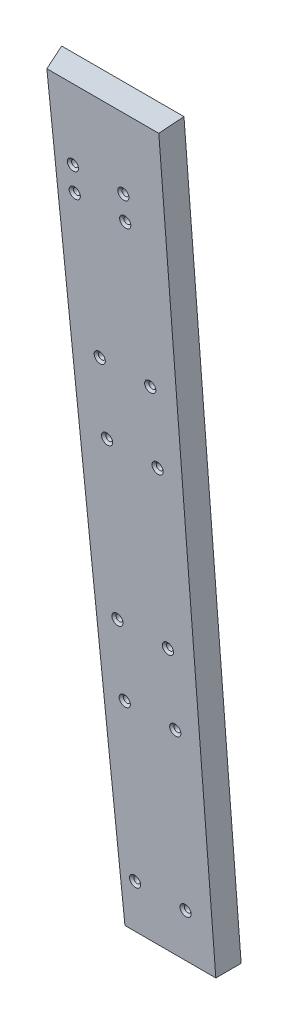
ISO-10303-21;
HEADER;
FILE_DESCRIPTION(('STEP AP214'),'2;1');
FILE_NAME('part.step','',(''),(''),'','','');
FILE_SCHEMA(('AUTOMOTIVE_DESIGN { 1 0 10303 214 1 1 1 1 }'));
ENDSEC;
DATA;
#1=APPLICATION_CONTEXT('core data for automotive mechanical design processes');
#2=APPLICATION_PROTOCOL_DEFINITION('international standard','automotive_design',2000,#1);
#3=PRODUCT_CONTEXT('',#1,'mechanical');
#4=PRODUCT('Part','Part','',(#3));
#5=PRODUCT_RELATED_PRODUCT_CATEGORY('part','',(#4));
#6=PRODUCT_DEFINITION_FORMATION('','',#4);
#7=PRODUCT_DEFINITION_CONTEXT('part definition',#1,'design');
#8=PRODUCT_DEFINITION('design','',#6,#7);
#9=PRODUCT_DEFINITION_SHAPE('','',#8);
#10=(LENGTH_UNIT() NAMED_UNIT(*) SI_UNIT(.MILLI.,.METRE.));
#11=(NAMED_UNIT(*) PLANE_ANGLE_UNIT() SI_UNIT($,.RADIAN.));
#12=(NAMED_UNIT(*) SI_UNIT($,.STERADIAN.) SOLID_ANGLE_UNIT());
#13=UNCERTAINTY_MEASURE_WITH_UNIT(LENGTH_MEASURE(1.E-05),#10,'distance_accuracy_value','');
#14=(GEOMETRIC_REPRESENTATION_CONTEXT(3) GLOBAL_UNCERTAINTY_ASSIGNED_CONTEXT((#13)) GLOBAL_UNIT_ASSIGNED_CONTEXT((#10,
#11,#12)) REPRESENTATION_CONTEXT('',''));
#15=CARTESIAN_POINT('',(0.,0.,0.));
#16=DIRECTION('',(0.,0.,1.));
#17=DIRECTION('',(1.,0.,0.));
#18=AXIS2_PLACEMENT_3D('',#15,#16,#17);
#19=CARTESIAN_POINT('',(-312.419999999991,5767.77608949546,3278.73923989057));
#20=DIRECTION('',(0.,-0.0748289111295099,0.997196386906397));
#21=DIRECTION('',(0.,-0.997196386906397,-0.0748289111295098));
#22=AXIS2_PLACEMENT_3D('',#19,#20,#21);
#23=PLANE('',#22);
#24=CARTESIAN_POINT('',(-343.4825,5710.44401659627,3274.43708171574));
#25=DIRECTION('',(0.,0.0748289111295102,-0.997196386906397));
#26=DIRECTION('',(0.,-0.997196386906397,-0.0748289111295098));
#27=AXIS2_PLACEMENT_3D('',#24,#25,#26);
#28=CIRCLE('',#27,4.21640000000001);
#29=CARTESIAN_POINT('',(-343.4825,5706.23943775052,3274.12157309485));
#30=VERTEX_POINT('',#29);
#31=EDGE_CURVE('E549',#30,#30,#28,.T.);
#32=ORIENTED_EDGE('',*,*,#31,.T.);
#33=EDGE_LOOP('',(#32));
#34=FACE_BOUND('',#33,.T.);
#35=CARTESIAN_POINT('',(-381.582499999999,5710.44401659627,3274.43708171574));
#36=DIRECTION('',(0.,0.0748289111295102,-0.997196386906397));
#37=DIRECTION('',(0.,-0.997196386906397,-0.0748289111295098));
#38=AXIS2_PLACEMENT_3D('',#35,#36,#37);
#39=CIRCLE('',#38,4.21640000000001);
#40=CARTESIAN_POINT('',(-381.582499999999,5706.23943775052,3274.12157309485));
#41=VERTEX_POINT('',#40);
#42=EDGE_CURVE('E247',#41,#41,#39,.T.);
#43=ORIENTED_EDGE('',*,*,#42,.T.);
#44=EDGE_LOOP('',(#43));
#45=FACE_BOUND('',#44,.T.);
#46=CARTESIAN_POINT('',(-381.582499999996,5691.4474254257,3273.01159095872));
#47=DIRECTION('',(0.,0.0748289111295102,-0.997196386906397));
#48=DIRECTION('',(0.,-0.997196386906397,-0.0748289111295098));
#49=AXIS2_PLACEMENT_3D('',#46,#47,#48);
#50=CIRCLE('',#49,4.21640000000001);
#51=CARTESIAN_POINT('',(-381.582499999996,5687.24284657995,3272.69608233784));
#52=VERTEX_POINT('',#51);
#53=EDGE_CURVE('E240',#52,#52,#50,.T.);
#54=ORIENTED_EDGE('',*,*,#53,.T.);
#55=EDGE_LOOP('',(#54));
#56=FACE_BOUND('',#55,.T.);
#57=CARTESIAN_POINT('',(-343.482499999996,5691.4474254257,3273.01159095872));
#58=DIRECTION('',(0.,0.0748289111295102,-0.997196386906397));
#59=DIRECTION('',(0.,-0.997196386906397,-0.0748289111295098));
#60=AXIS2_PLACEMENT_3D('',#57,#58,#59);
#61=CIRCLE('',#60,4.21640000000001);
#62=CARTESIAN_POINT('',(-343.482499999996,5687.24284657995,3272.69608233784));
#63=VERTEX_POINT('',#62);
#64=EDGE_CURVE('E236',#63,#63,#61,.T.);
#65=ORIENTED_EDGE('',*,*,#64,.T.);
#66=EDGE_LOOP('',(#65));
#67=FACE_BOUND('',#66,.T.);
#68=CARTESIAN_POINT('',(-332.585534838779,5585.2546610977,3265.04296107916));
#69=DIRECTION('',(0.,0.0748289111295102,-0.997196386906397));
#70=DIRECTION('',(0.,-0.997196386906397,-0.0748289111295098));
#71=AXIS2_PLACEMENT_3D('',#68,#69,#70);
#72=CIRCLE('',#71,4.21640000000001);
#73=CARTESIAN_POINT('',(-332.585534838779,5581.05008225195,3264.72745245827));
#74=VERTEX_POINT('',#73);
#75=EDGE_CURVE('E232',#74,#74,#72,.T.);
#76=ORIENTED_EDGE('',*,*,#75,.T.);
#77=EDGE_LOOP('',(#76));
#78=FACE_BOUND('',#77,.T.);
#79=CARTESIAN_POINT('',(-370.69930150267,5585.25466111012,3265.04296108009));
#80=DIRECTION('',(0.,0.0748289111295102,-0.997196386906397));
#81=DIRECTION('',(0.,-0.997196386906397,-0.0748289111295098));
#82=AXIS2_PLACEMENT_3D('',#79,#80,#81);
#83=CIRCLE('',#82,4.21640000000001);
#84=CARTESIAN_POINT('',(-370.69930150267,5581.05008226437,3264.7274524592));
#85=VERTEX_POINT('',#84);
#86=EDGE_CURVE('E227',#85,#85,#83,.T.);
#87=ORIENTED_EDGE('',*,*,#86,.T.);
#88=EDGE_LOOP('',(#87));
#89=FACE_BOUND('',#88,.T.);
#90=CARTESIAN_POINT('',(-369.230750677279,5530.74435745181,3260.95254647205));
#91=DIRECTION('',(0.,0.0748289111295102,-0.997196386906397));
#92=DIRECTION('',(0.,-0.997196386906397,-0.0748289111295098));
#93=AXIS2_PLACEMENT_3D('',#90,#91,#92);
#94=CIRCLE('',#93,4.21640000000001);
#95=CARTESIAN_POINT('',(-369.230750677279,5526.53977860606,3260.63703785116));
#96=VERTEX_POINT('',#95);
#97=EDGE_CURVE('E222',#96,#96,#94,.T.);
#98=ORIENTED_EDGE('',*,*,#97,.T.);
#99=EDGE_LOOP('',(#98));
#100=FACE_BOUND('',#99,.T.);
#101=CARTESIAN_POINT('',(-331.116984014259,5530.744357472,3260.95254647356));
#102=DIRECTION('',(0.,0.0748289111295102,-0.997196386906397));
#103=DIRECTION('',(0.,-0.997196386906397,-0.0748289111295098));
#104=AXIS2_PLACEMENT_3D('',#101,#102,#103);
#105=CIRCLE('',#104,4.21640000000001);
#106=CARTESIAN_POINT('',(-331.116984014259,5526.53977862625,3260.63703785267));
#107=VERTEX_POINT('',#106);
#108=EDGE_CURVE('E217',#107,#107,#105,.T.);
#109=ORIENTED_EDGE('',*,*,#108,.T.);
#110=EDGE_LOOP('',(#109));
#111=FACE_BOUND('',#110,.T.);
#112=CARTESIAN_POINT('',(-332.585534839494,5407.45466109737,3251.7009749132));
#113=DIRECTION('',(0.,0.0748289111295102,-0.997196386906397));
#114=DIRECTION('',(0.,-0.997196386906397,-0.0748289111295098));
#115=AXIS2_PLACEMENT_3D('',#112,#113,#114);
#116=CIRCLE('',#115,4.21640000000001);
#117=CARTESIAN_POINT('',(-332.585534839494,5403.25008225162,3251.38546629231));
#118=VERTEX_POINT('',#117);
#119=EDGE_CURVE('E212',#118,#118,#116,.T.);
#120=ORIENTED_EDGE('',*,*,#119,.T.);
#121=EDGE_LOOP('',(#120));
#122=FACE_BOUND('',#121,.T.);
#123=CARTESIAN_POINT('',(-370.699301503385,5407.45466110812,3251.700974914));
#124=DIRECTION('',(0.,0.0748289111295102,-0.997196386906397));
#125=DIRECTION('',(0.,-0.997196386906397,-0.0748289111295098));
#126=AXIS2_PLACEMENT_3D('',#123,#124,#125);
#127=CIRCLE('',#126,4.21640000000001);
#128=CARTESIAN_POINT('',(-370.699301503385,5403.25008226237,3251.38546629312));
#129=VERTEX_POINT('',#128);
#130=EDGE_CURVE('E207',#129,#129,#127,.T.);
#131=ORIENTED_EDGE('',*,*,#130,.T.);
#132=EDGE_LOOP('',(#131));
#133=FACE_BOUND('',#132,.T.);
#134=CARTESIAN_POINT('',(-369.230853476841,5352.94435745353,3247.61056030624));
#135=DIRECTION('',(0.,0.0748289111295102,-0.997196386906397));
#136=DIRECTION('',(0.,-0.997196386906397,-0.0748289111295098));
#137=AXIS2_PLACEMENT_3D('',#134,#135,#136);
#138=CIRCLE('',#137,4.21640000000001);
#139=CARTESIAN_POINT('',(-369.230853476841,5348.73977860778,3247.29505168535));
#140=VERTEX_POINT('',#139);
#141=EDGE_CURVE('E202',#140,#140,#138,.T.);
#142=ORIENTED_EDGE('',*,*,#141,.T.);
#143=EDGE_LOOP('',(#142));
#144=FACE_BOUND('',#143,.T.);
#145=CARTESIAN_POINT('',(-331.117086813821,5352.94435747206,3247.61056030763));
#146=DIRECTION('',(0.,0.0748289111295102,-0.997196386906397));
#147=DIRECTION('',(0.,-0.997196386906397,-0.0748289111295098));
#148=AXIS2_PLACEMENT_3D('',#145,#146,#147);
#149=CIRCLE('',#148,4.21640000000001);
#150=CARTESIAN_POINT('',(-331.117086813821,5348.73977862631,3247.29505168674));
#151=VERTEX_POINT('',#150);
#152=EDGE_CURVE('E197',#151,#151,#149,.T.);
#153=ORIENTED_EDGE('',*,*,#152,.T.);
#154=EDGE_LOOP('',(#153));
#155=FACE_BOUND('',#154,.T.);
#156=CARTESIAN_POINT('',(-370.699301503411,5229.65466110812,3238.35898874807));
#157=DIRECTION('',(0.,0.0748289111295102,-0.997196386906397));
#158=DIRECTION('',(0.,-0.997196386906397,-0.0748289111295098));
#159=AXIS2_PLACEMENT_3D('',#156,#157,#158);
#160=CIRCLE('',#159,4.21640000000001);
#161=CARTESIAN_POINT('',(-370.699301503411,5225.45008226237,3238.04348012718));
#162=VERTEX_POINT('',#161);
#163=EDGE_CURVE('E192',#162,#162,#160,.T.);
#164=ORIENTED_EDGE('',*,*,#163,.T.);
#165=EDGE_LOOP('',(#164));
#166=FACE_BOUND('',#165,.T.);
#167=CARTESIAN_POINT('',(-332.585534839519,5229.65466109737,3238.35898874726));
#168=DIRECTION('',(0.,0.0748289111295102,-0.997196386906397));
#169=DIRECTION('',(0.,-0.997196386906397,-0.0748289111295098));
#170=AXIS2_PLACEMENT_3D('',#167,#168,#169);
#171=CIRCLE('',#170,4.21640000000001);
#172=CARTESIAN_POINT('',(-332.585534839519,5225.45008225161,3238.04348012637));
#173=VERTEX_POINT('',#172);
#174=EDGE_CURVE('E183',#173,#173,#171,.T.);
#175=ORIENTED_EDGE('',*,*,#174,.T.);
#176=EDGE_LOOP('',(#175));
#177=FACE_BOUND('',#176,.T.);
#178=DIRECTION('',(0.,-0.997196386906396,-0.0748289111295136));
#179=VECTOR('',#178,1.);
#180=CARTESIAN_POINT('',(-312.419999999991,5767.77608949546,3278.73923989057));
#181=LINE('',#180,#179);
#182=CARTESIAN_POINT('',(-312.419999999993,5767.77608949546,3278.73923989057));
#183=VERTEX_POINT('',#182);
#184=CARTESIAN_POINT('',(-312.419999999994,5194.3,3235.706));
#185=VERTEX_POINT('',#184);
#186=EDGE_CURVE('E164',#183,#185,#181,.T.);
#187=ORIENTED_EDGE('',*,*,#186,.F.);
#188=DIRECTION('',(-1.,0.,0.));
#189=VECTOR('',#188,1.);
#190=CARTESIAN_POINT('',(-312.419999999993,5767.77608949546,3278.73923989057));
#191=LINE('',#190,#189);
#192=CARTESIAN_POINT('',(-396.897181125409,5767.77608949542,3278.73923989111));
#193=VERTEX_POINT('',#192);
#194=EDGE_CURVE('E110',#183,#193,#191,.T.);
#195=ORIENTED_EDGE('',*,*,#194,.T.);
#196=DIRECTION('',(0.0276324655190278,-0.996815607984741,-0.074800337748909));
#197=VECTOR('',#196,1.);
#198=CARTESIAN_POINT('',(-388.968512318233,5481.75670364397,3257.27654760126));
#199=LINE('',#198,#197);
#200=CARTESIAN_POINT('',(-380.999999999786,5194.3,3235.70600000048));
#201=VERTEX_POINT('',#200);
#202=EDGE_CURVE('E107',#193,#201,#199,.T.);
#203=ORIENTED_EDGE('',*,*,#202,.T.);
#204=DIRECTION('',(-1.,0.,0.));
#205=VECTOR('',#204,1.);
#206=CARTESIAN_POINT('',(-312.419999999994,5194.3,3235.706));
#207=LINE('',#206,#205);
#208=EDGE_CURVE('E103',#201,#185,#207,.F.);
#209=ORIENTED_EDGE('',*,*,#208,.T.);
#210=EDGE_LOOP('',(#187,#195,#203,#209));
#211=FACE_BOUND('',#210,.T.);
#212=ADVANCED_FACE('F51',(#34,#45,#56,#67,#78,#89,#100,#111,#122,#133,#144,#155,#166,#177,#211),
#23,.T.);
#213=CARTESIAN_POINT('',(-405.196853838778,5769.20076169359,3258.48146242823));
#214=CARTESIAN_POINT('',(-399.713953138319,5577.55929881065,3244.52122134531));
#215=CARTESIAN_POINT('',(-394.23105467258,5385.91783579813,3230.56097424694));
#216=CARTESIAN_POINT('',(-388.748158914667,5194.27637261327,3216.60071985851));
#217=CARTESIAN_POINT('',(-402.536032037971,5769.20517503957,3265.26188551318));
#218=CARTESIAN_POINT('',(-397.108078605893,5577.56498966864,3251.16176934717));
#219=CARTESIAN_POINT('',(-391.680127390667,5385.92480418547,3237.06164916942));
#220=CARTESIAN_POINT('',(-386.252177322124,5194.28461860905,3222.96152394867));
#221=CARTESIAN_POINT('',(-399.782874856833,5769.20939052787,3272.0504417052));
#222=CARTESIAN_POINT('',(-394.41177201546,5577.57042539221,3257.81028396343));
#223=CARTESIAN_POINT('',(-389.040670658159,5385.93146018714,3243.57012421449));
#224=CARTESIAN_POINT('',(-383.669569532891,5194.29249494666,3229.32996185289));
#225=CARTESIAN_POINT('',(-396.937024636894,5769.21340728805,3278.84709520156));
#226=CARTESIAN_POINT('',(-391.624683091119,5577.57560485866,3264.46673013469));
#227=CARTESIAN_POINT('',(-386.312341545347,5385.93780242927,3250.08636506784));
#228=CARTESIAN_POINT('',(-380.999999999574,5194.2999999999,3235.70600000099));
#229=B_SPLINE_SURFACE_WITH_KNOTS('',3,3,((#213,#214,#215,#216),(#217,#218,#219,#220),(#221,#222,
#223,#224),(#225,#226,#227,#228)),.UNSPECIFIED.,.F.,.F.,.F.,(4,4),(4,4),(-0.0263043909921353,
1.3801359465942E-12),(66.3393463865698,123.945907551582),.UNSPECIFIED.);
#230=CARTESIAN_POINT('',(-396.897181125633,5767.77608949546,3278.73923989057));
#231=CARTESIAN_POINT('',(-400.918309179509,5768.48911461938,3269.23721631951));
#232=CARTESIAN_POINT('',(-404.700902723823,5769.20158025248,3259.74264872));
#233=B_SPLINE_CURVE_WITH_KNOTS('',2,(#230,#231,#232),.UNSPECIFIED.,.F.,.F.,(3,3),(0.,1.),.UNSPECIFIED.);
#234=CARTESIAN_POINT('',(-404.700902445729,5769.20158025436,3259.74264872015));
#235=VERTEX_POINT('',#234);
#236=EDGE_CURVE('E109',#193,#235,#233,.T.);
#237=CARTESIAN_POINT('',(-404.700902167638,5769.20158025625,3259.74264872029));
#238=CARTESIAN_POINT('',(-404.293319696534,5754.51171006711,3258.64033125774));
#239=CARTESIAN_POINT('',(-403.885735478663,5739.82183992616,3257.53801379879));
#240=CARTESIAN_POINT('',(-401.847805523786,5666.37248946604,3252.02642652244));
#241=CARTESIAN_POINT('',(-400.217433190219,5607.61300988067,3247.61715676009));
#242=CARTESIAN_POINT('',(-396.947394798611,5489.76127418242,3238.77364592028));
#243=CARTESIAN_POINT('',(-395.307728399178,5430.66901807895,3234.33940484353));
#244=CARTESIAN_POINT('',(-392.028331025049,5312.48450765377,3225.47092282373));
#245=CARTESIAN_POINT('',(-390.388600050353,5253.39225333204,3221.03668188067));
#246=CARTESIAN_POINT('',(-388.748834896994,5194.29999995344,3216.6024410084));
#247=B_SPLINE_CURVE_WITH_KNOTS('',3,(#237,#238,#239,#240,#241,#242,#243,#244,#245,#246),
.UNSPECIFIED.,.F.,.F.,(4,2,2,2,4),(0.,44.2104243464687,221.052121732369,398.895343647117,
576.738565562069),.UNSPECIFIED.);
#248=CARTESIAN_POINT('',(-388.748833941193,5194.3,3216.60244129906));
#249=VERTEX_POINT('',#248);
#250=EDGE_CURVE('E92',#235,#249,#247,.T.);
#251=CARTESIAN_POINT('',(-388.748834672876,5194.3,3216.60244158623));
#252=CARTESIAN_POINT('',(-388.075829832683,5194.30000000001,3218.31721533993));
#253=CARTESIAN_POINT('',(-387.397559503474,5194.30000000001,3220.02991977191));
#254=CARTESIAN_POINT('',(-386.030596461003,5194.30000000001,3223.45116430792));
#255=CARTESIAN_POINT('',(-385.341903748527,5194.3,3225.15970441225));
#256=CARTESIAN_POINT('',(-383.447384508369,5194.3,3229.81906148917));
#257=CARTESIAN_POINT('',(-382.231272738759,5194.29999999999,3232.76570034628));
#258=CARTESIAN_POINT('',(-380.99999999979,5194.3,3235.70600000049));
#259=B_SPLINE_CURVE_WITH_KNOTS('',3,(#251,#252,#253,#254,#255,#256,#257,#258),.UNSPECIFIED.,.F.,
.F.,(4,2,2,4),(0.,5.52632896508943,11.05265751321,20.6156723645513),.UNSPECIFIED.);
#260=EDGE_CURVE('E100',#249,#201,#259,.T.);
#261=ORIENTED_EDGE('',*,*,#236,.T.);
#262=ORIENTED_EDGE('',*,*,#250,.T.);
#263=ORIENTED_EDGE('',*,*,#260,.T.);
#264=ORIENTED_EDGE('',*,*,#202,.F.);
#265=EDGE_LOOP('',(#261,#262,#263,#264));
#266=FACE_BOUND('',#265,.T.);
#267=ADVANCED_FACE('F53',(#266),#229,.F.);
#268=CARTESIAN_POINT('',(-312.419999999994,5194.3,3235.706));
#269=DIRECTION('',(0.,-1.,0.));
#270=DIRECTION('',(0.,0.,-1.));
#271=AXIS2_PLACEMENT_3D('',#268,#269,#270);
#272=PLANE('',#271);
#273=DIRECTION('',(0.,0.,-1.));
#274=VECTOR('',#273,1.);
#275=CARTESIAN_POINT('',(-312.419999999991,5194.3,3247.67084045122));
#276=LINE('',#275,#274);
#277=CARTESIAN_POINT('',(-312.419999999994,5194.3,3216.60244101189));
#278=VERTEX_POINT('',#277);
#279=EDGE_CURVE('E144',#185,#278,#276,.T.);
#280=ORIENTED_EDGE('',*,*,#279,.F.);
#281=ORIENTED_EDGE('',*,*,#208,.F.);
#282=ORIENTED_EDGE('',*,*,#260,.F.);
#283=DIRECTION('',(-1.,0.,0.));
#284=VECTOR('',#283,1.);
#285=CARTESIAN_POINT('',(-312.419999999994,5194.3,3216.60244101189));
#286=LINE('',#285,#284);
#287=EDGE_CURVE('E88',#249,#278,#286,.F.);
#288=ORIENTED_EDGE('',*,*,#287,.T.);
#289=EDGE_LOOP('',(#280,#281,#282,#288));
#290=FACE_BOUND('',#289,.T.);
#291=ADVANCED_FACE('F101',(#290),#272,.T.);
#292=CARTESIAN_POINT('',(-312.419999999992,5481.75079012623,3247.67084045122));
#293=DIRECTION('',(-1.,0.,0.));
#294=DIRECTION('',(0.,0.,-1.));
#295=AXIS2_PLACEMENT_3D('',#292,#293,#294);
#296=PLANE('',#295);
#297=ORIENTED_EDGE('',*,*,#279,.T.);
#298=DIRECTION('',(0.,0.997196386906396,0.074828911129511));
#299=VECTOR('',#298,1.);
#300=CARTESIAN_POINT('',(-312.419999999994,5194.3,3216.60244101189));
#301=LINE('',#300,#299);
#302=CARTESIAN_POINT('',(-312.419999999994,5769.20158025247,3259.74264872001));
#303=VERTEX_POINT('',#302);
#304=EDGE_CURVE('E64',#278,#303,#301,.T.);
#305=ORIENTED_EDGE('',*,*,#304,.T.);
#306=DIRECTION('',(0.,-0.0748289111295179,0.997196386906396));
#307=VECTOR('',#306,1.);
#308=CARTESIAN_POINT('',(-312.419999999993,5769.20158025248,3259.74264872));
#309=LINE('',#308,#307);
#310=EDGE_CURVE('E113',#303,#183,#309,.T.);
#311=ORIENTED_EDGE('',*,*,#310,.T.);
#312=ORIENTED_EDGE('',*,*,#186,.T.);
#313=EDGE_LOOP('',(#297,#305,#311,#312));
#314=FACE_BOUND('',#313,.T.);
#315=ADVANCED_FACE('F139',(#314),#296,.F.);
#316=CARTESIAN_POINT('',(-312.419999999993,5769.20158025248,3259.74264872));
#317=DIRECTION('',(0.,0.997196386906396,0.0748289111295173));
#318=DIRECTION('',(0.,-0.0748289111295179,0.997196386906396));
#319=AXIS2_PLACEMENT_3D('',#316,#317,#318);
#320=PLANE('',#319);
#321=ORIENTED_EDGE('',*,*,#310,.F.);
#322=DIRECTION('',(-1.,0.,0.));
#323=VECTOR('',#322,1.);
#324=CARTESIAN_POINT('',(-312.419999999994,5769.20158025248,3259.74264872001));
#325=LINE('',#324,#323);
#326=EDGE_CURVE('E13',#303,#235,#325,.T.);
#327=ORIENTED_EDGE('',*,*,#326,.T.);
#328=ORIENTED_EDGE('',*,*,#236,.F.);
#329=ORIENTED_EDGE('',*,*,#194,.F.);
#330=EDGE_LOOP('',(#321,#327,#328,#329));
#331=FACE_BOUND('',#330,.T.);
#332=ADVANCED_FACE('F133',(#331),#320,.T.);
#333=CARTESIAN_POINT('',(-312.419999999994,5194.3,3216.60244101189));
#334=DIRECTION('',(0.,0.0748289111295115,-0.997196386906397));
#335=DIRECTION('',(0.,0.997196386906396,0.074828911129511));
#336=AXIS2_PLACEMENT_3D('',#333,#334,#335);
#337=PLANE('',#336);
#338=CARTESIAN_POINT('',(-343.482499999997,5711.86950735329,3255.44049054518));
#339=DIRECTION('',(0.,-0.0748289111295115,0.997196386906397));
#340=DIRECTION('',(0.,0.997196386906396,0.074828911129511));
#341=AXIS2_PLACEMENT_3D('',#338,#339,#340);
#342=CIRCLE('',#341,2.45744999999997);
#343=CARTESIAN_POINT('',(-343.482499999997,5714.32006761429,3255.62437885283));
#344=VERTEX_POINT('',#343);
#345=EDGE_CURVE('E58',#344,#344,#342,.T.);
#346=ORIENTED_EDGE('',*,*,#345,.T.);
#347=EDGE_LOOP('',(#346));
#348=FACE_BOUND('',#347,.T.);
#349=CARTESIAN_POINT('',(-381.582499999998,5711.86950735329,3255.44049054518));
#350=DIRECTION('',(0.,-0.0748289111295115,0.997196386906397));
#351=DIRECTION('',(0.,0.997196386906396,0.074828911129511));
#352=AXIS2_PLACEMENT_3D('',#349,#350,#351);
#353=CIRCLE('',#352,2.45744999999997);
#354=CARTESIAN_POINT('',(-381.582499999998,5714.32006761429,3255.62437885283));
#355=VERTEX_POINT('',#354);
#356=EDGE_CURVE('E238',#355,#355,#353,.T.);
#357=ORIENTED_EDGE('',*,*,#356,.T.);
#358=EDGE_LOOP('',(#357));
#359=FACE_BOUND('',#358,.T.);
#360=CARTESIAN_POINT('',(-381.582499999997,5692.87291618272,3254.01499978816));
#361=DIRECTION('',(0.,-0.0748289111295115,0.997196386906397));
#362=DIRECTION('',(0.,0.997196386906396,0.074828911129511));
#363=AXIS2_PLACEMENT_3D('',#360,#361,#362);
#364=CIRCLE('',#363,2.45744999999997);
#365=CARTESIAN_POINT('',(-381.582499999997,5695.32347644372,3254.19888809582));
#366=VERTEX_POINT('',#365);
#367=EDGE_CURVE('E234',#366,#366,#364,.T.);
#368=ORIENTED_EDGE('',*,*,#367,.T.);
#369=EDGE_LOOP('',(#368));
#370=FACE_BOUND('',#369,.T.);
#371=CARTESIAN_POINT('',(-343.482499999998,5692.87291618272,3254.01499978816));
#372=DIRECTION('',(0.,-0.0748289111295115,0.997196386906397));
#373=DIRECTION('',(0.,0.997196386906396,0.074828911129511));
#374=AXIS2_PLACEMENT_3D('',#371,#372,#373);
#375=CIRCLE('',#374,2.45744999999997);
#376=CARTESIAN_POINT('',(-343.482499999998,5695.32347644372,3254.19888809582));
#377=VERTEX_POINT('',#376);
#378=EDGE_CURVE('E229',#377,#377,#375,.T.);
#379=ORIENTED_EDGE('',*,*,#378,.T.);
#380=EDGE_LOOP('',(#379));
#381=FACE_BOUND('',#380,.T.);
#382=CARTESIAN_POINT('',(-332.585534838779,5586.68015185472,3246.04636990859));
#383=DIRECTION('',(0.,-0.0748289111295115,0.997196386906397));
#384=DIRECTION('',(0.,0.997196386906396,0.074828911129511));
#385=AXIS2_PLACEMENT_3D('',#382,#383,#384);
#386=CIRCLE('',#385,2.45744999999997);
#387=CARTESIAN_POINT('',(-332.585534838779,5589.13071211572,3246.23025821625));
#388=VERTEX_POINT('',#387);
#389=EDGE_CURVE('E224',#388,#388,#386,.T.);
#390=ORIENTED_EDGE('',*,*,#389,.T.);
#391=EDGE_LOOP('',(#390));
#392=FACE_BOUND('',#391,.T.);
#393=CARTESIAN_POINT('',(-370.699301502672,5586.68015186713,3246.04636990953));
#394=DIRECTION('',(0.,-0.0748289111295115,0.997196386906397));
#395=DIRECTION('',(0.,0.997196386906396,0.074828911129511));
#396=AXIS2_PLACEMENT_3D('',#393,#394,#395);
#397=CIRCLE('',#396,2.45744999999997);
#398=CARTESIAN_POINT('',(-370.699301502672,5589.13071212814,3246.23025821718));
#399=VERTEX_POINT('',#398);
#400=EDGE_CURVE('E219',#399,#399,#397,.T.);
#401=ORIENTED_EDGE('',*,*,#400,.T.);
#402=EDGE_LOOP('',(#401));
#403=FACE_BOUND('',#402,.T.);
#404=CARTESIAN_POINT('',(-369.230750677279,5532.16984820883,3241.95595530148));
#405=DIRECTION('',(0.,-0.0748289111295115,0.997196386906397));
#406=DIRECTION('',(0.,0.997196386906396,0.074828911129511));
#407=AXIS2_PLACEMENT_3D('',#404,#405,#406);
#408=CIRCLE('',#407,2.45744999999997);
#409=CARTESIAN_POINT('',(-369.230750677279,5534.62040846983,3242.13984360914));
#410=VERTEX_POINT('',#409);
#411=EDGE_CURVE('E214',#410,#410,#408,.T.);
#412=ORIENTED_EDGE('',*,*,#411,.T.);
#413=EDGE_LOOP('',(#412));
#414=FACE_BOUND('',#413,.T.);
#415=CARTESIAN_POINT('',(-331.116984014263,5532.16984822902,3241.955955303));
#416=DIRECTION('',(0.,-0.0748289111295115,0.997196386906397));
#417=DIRECTION('',(0.,0.997196386906396,0.074828911129511));
#418=AXIS2_PLACEMENT_3D('',#415,#416,#417);
#419=CIRCLE('',#418,2.45744999999997);
#420=CARTESIAN_POINT('',(-331.116984014263,5534.62040849003,3242.13984361065));
#421=VERTEX_POINT('',#420);
#422=EDGE_CURVE('E209',#421,#421,#419,.T.);
#423=ORIENTED_EDGE('',*,*,#422,.T.);
#424=EDGE_LOOP('',(#423));
#425=FACE_BOUND('',#424,.T.);
#426=CARTESIAN_POINT('',(-332.585534839493,5408.88015185439,3232.70438374263));
#427=DIRECTION('',(0.,-0.0748289111295115,0.997196386906397));
#428=DIRECTION('',(0.,0.997196386906396,0.074828911129511));
#429=AXIS2_PLACEMENT_3D('',#426,#427,#428);
#430=CIRCLE('',#429,2.45744999999997);
#431=CARTESIAN_POINT('',(-332.585534839493,5411.33071211539,3232.88827205029));
#432=VERTEX_POINT('',#431);
#433=EDGE_CURVE('E204',#432,#432,#430,.T.);
#434=ORIENTED_EDGE('',*,*,#433,.T.);
#435=EDGE_LOOP('',(#434));
#436=FACE_BOUND('',#435,.T.);
#437=CARTESIAN_POINT('',(-370.699301503383,5408.88015186514,3232.70438374344));
#438=DIRECTION('',(0.,-0.0748289111295115,0.997196386906397));
#439=DIRECTION('',(0.,0.997196386906396,0.074828911129511));
#440=AXIS2_PLACEMENT_3D('',#437,#438,#439);
#441=CIRCLE('',#440,2.45744999999997);
#442=CARTESIAN_POINT('',(-370.699301503383,5411.33071212614,3232.88827205109));
#443=VERTEX_POINT('',#442);
#444=EDGE_CURVE('E199',#443,#443,#441,.T.);
#445=ORIENTED_EDGE('',*,*,#444,.T.);
#446=EDGE_LOOP('',(#445));
#447=FACE_BOUND('',#446,.T.);
#448=CARTESIAN_POINT('',(-369.23085347684,5354.36984821055,3228.61396913567));
#449=DIRECTION('',(0.,-0.0748289111295115,0.997196386906397));
#450=DIRECTION('',(0.,0.997196386906396,0.074828911129511));
#451=AXIS2_PLACEMENT_3D('',#448,#449,#450);
#452=CIRCLE('',#451,2.45744999999997);
#453=CARTESIAN_POINT('',(-369.23085347684,5356.82040847155,3228.79785744333));
#454=VERTEX_POINT('',#453);
#455=EDGE_CURVE('E194',#454,#454,#452,.T.);
#456=ORIENTED_EDGE('',*,*,#455,.T.);
#457=EDGE_LOOP('',(#456));
#458=FACE_BOUND('',#457,.T.);
#459=CARTESIAN_POINT('',(-331.117086813821,5354.36984822908,3228.61396913707));
#460=DIRECTION('',(0.,-0.0748289111295115,0.997196386906397));
#461=DIRECTION('',(0.,0.997196386906396,0.074828911129511));
#462=AXIS2_PLACEMENT_3D('',#459,#460,#461);
#463=CIRCLE('',#462,2.45744999999997);
#464=CARTESIAN_POINT('',(-331.117086813821,5356.82040849008,3228.79785744472));
#465=VERTEX_POINT('',#464);
#466=EDGE_CURVE('E189',#465,#465,#463,.T.);
#467=ORIENTED_EDGE('',*,*,#466,.T.);
#468=EDGE_LOOP('',(#467));
#469=FACE_BOUND('',#468,.T.);
#470=CARTESIAN_POINT('',(-370.699301503411,5231.08015186514,3219.3623975775));
#471=DIRECTION('',(0.,-0.0748289111295115,0.997196386906397));
#472=DIRECTION('',(0.,0.997196386906396,0.074828911129511));
#473=AXIS2_PLACEMENT_3D('',#470,#471,#472);
#474=CIRCLE('',#473,2.45744999999997);
#475=CARTESIAN_POINT('',(-370.699301503411,5233.53071212614,3219.54628588516));
#476=VERTEX_POINT('',#475);
#477=EDGE_CURVE('E185',#476,#476,#474,.T.);
#478=ORIENTED_EDGE('',*,*,#477,.T.);
#479=EDGE_LOOP('',(#478));
#480=FACE_BOUND('',#479,.T.);
#481=CARTESIAN_POINT('',(-332.585534839518,5231.08015185438,3219.3623975767));
#482=DIRECTION('',(0.,-0.0748289111295115,0.997196386906397));
#483=DIRECTION('',(0.,0.997196386906396,0.074828911129511));
#484=AXIS2_PLACEMENT_3D('',#481,#482,#483);
#485=CIRCLE('',#484,2.45744999999997);
#486=CARTESIAN_POINT('',(-332.585534839518,5233.53071211539,3219.54628588435));
#487=VERTEX_POINT('',#486);
#488=EDGE_CURVE('E178',#487,#487,#485,.T.);
#489=ORIENTED_EDGE('',*,*,#488,.T.);
#490=EDGE_LOOP('',(#489));
#491=FACE_BOUND('',#490,.T.);
#492=ORIENTED_EDGE('',*,*,#304,.F.);
#493=ORIENTED_EDGE('',*,*,#287,.F.);
#494=ORIENTED_EDGE('',*,*,#250,.F.);
#495=ORIENTED_EDGE('',*,*,#326,.F.);
#496=EDGE_LOOP('',(#492,#493,#494,#495));
#497=FACE_BOUND('',#496,.T.);
#498=ADVANCED_FACE('F90',(#348,#359,#370,#381,#392,#403,#414,#425,#436,#447,#458,#469,#480,#491,
#497),#337,.T.);
#499=CARTESIAN_POINT('',(-332.585534839519,5229.65466109737,3238.35898874726));
#500=DIRECTION('',(0.,-0.0748289111295102,0.997196386906397));
#501=DIRECTION('',(0.,-0.997196386906397,-0.0748289111295098));
#502=AXIS2_PLACEMENT_3D('',#499,#500,#501);
#503=CYLINDRICAL_SURFACE('',#502,2.45744999999997);
#504=ORIENTED_EDGE('',*,*,#488,.F.);
#505=EDGE_LOOP('',(#504));
#506=FACE_BOUND('',#505,.T.);
#507=CARTESIAN_POINT('',(-332.58553483952,5229.76510365366,3236.88719239972));
#508=DIRECTION('',(0.,0.0748289111295102,-0.997196386906397));
#509=DIRECTION('',(0.,-0.997196386906397,-0.0748289111295098));
#510=AXIS2_PLACEMENT_3D('',#507,#508,#509);
#511=CIRCLE('',#510,2.45744999999997);
#512=CARTESIAN_POINT('',(-332.58553483952,5227.31454339265,3236.70330409206));
#513=VERTEX_POINT('',#512);
#514=EDGE_CURVE('E145',#513,#513,#511,.T.);
#515=ORIENTED_EDGE('',*,*,#514,.F.);
#516=EDGE_LOOP('',(#515));
#517=FACE_BOUND('',#516,.T.);
#518=ADVANCED_FACE('F132',(#506,#517),#503,.F.);
#519=CARTESIAN_POINT('',(-332.585534839519,5229.65466109737,3238.35898874726));
#520=DIRECTION('',(0.,-0.0748289111295102,0.997196386906397));
#521=DIRECTION('',(0.,-0.997196386906397,-0.0748289111295098));
#522=AXIS2_PLACEMENT_3D('',#519,#520,#521);
#523=CONICAL_SURFACE('',#522,4.21640000000001,0.872664625997234);
#524=ORIENTED_EDGE('',*,*,#514,.T.);
#525=EDGE_LOOP('',(#524));
#526=FACE_BOUND('',#525,.T.);
#527=ORIENTED_EDGE('',*,*,#174,.F.);
#528=EDGE_LOOP('',(#527));
#529=FACE_BOUND('',#528,.T.);
#530=ADVANCED_FACE('F300',(#526,#529),#523,.F.);
#531=CARTESIAN_POINT('',(-370.699301503411,5229.65466110812,3238.35898874807));
#532=DIRECTION('',(0.,-0.0748289111295102,0.997196386906397));
#533=DIRECTION('',(0.,-0.997196386906397,-0.0748289111295098));
#534=AXIS2_PLACEMENT_3D('',#531,#532,#533);
#535=CYLINDRICAL_SURFACE('',#534,2.45744999999997);
#536=ORIENTED_EDGE('',*,*,#477,.F.);
#537=EDGE_LOOP('',(#536));
#538=FACE_BOUND('',#537,.T.);
#539=CARTESIAN_POINT('',(-370.699301503411,5229.76510366441,3236.88719240053));
#540=DIRECTION('',(0.,0.0748289111295102,-0.997196386906397));
#541=DIRECTION('',(0.,-0.997196386906397,-0.0748289111295098));
#542=AXIS2_PLACEMENT_3D('',#539,#540,#541);
#543=CIRCLE('',#542,2.45744999999997);
#544=CARTESIAN_POINT('',(-370.699301503411,5227.31454340341,3236.70330409287));
#545=VERTEX_POINT('',#544);
#546=EDGE_CURVE('E188',#545,#545,#543,.T.);
#547=ORIENTED_EDGE('',*,*,#546,.F.);
#548=EDGE_LOOP('',(#547));
#549=FACE_BOUND('',#548,.T.);
#550=ADVANCED_FACE('F302',(#538,#549),#535,.F.);
#551=CARTESIAN_POINT('',(-370.699301503411,5229.65466110812,3238.35898874807));
#552=DIRECTION('',(0.,-0.0748289111295102,0.997196386906397));
#553=DIRECTION('',(0.,-0.997196386906397,-0.0748289111295098));
#554=AXIS2_PLACEMENT_3D('',#551,#552,#553);
#555=CONICAL_SURFACE('',#554,4.21640000000001,0.872664625997234);
#556=ORIENTED_EDGE('',*,*,#546,.T.);
#557=EDGE_LOOP('',(#556));
#558=FACE_BOUND('',#557,.T.);
#559=ORIENTED_EDGE('',*,*,#163,.F.);
#560=EDGE_LOOP('',(#559));
#561=FACE_BOUND('',#560,.T.);
#562=ADVANCED_FACE('F308',(#558,#561),#555,.F.);
#563=CARTESIAN_POINT('',(-331.117086813821,5352.94435747206,3247.61056030763));
#564=DIRECTION('',(0.,-0.0748289111295102,0.997196386906397));
#565=DIRECTION('',(0.,-0.997196386906397,-0.0748289111295098));
#566=AXIS2_PLACEMENT_3D('',#563,#564,#565);
#567=CYLINDRICAL_SURFACE('',#566,2.45744999999997);
#568=ORIENTED_EDGE('',*,*,#466,.F.);
#569=EDGE_LOOP('',(#568));
#570=FACE_BOUND('',#569,.T.);
#571=CARTESIAN_POINT('',(-331.117086813824,5353.05480002835,3246.13876396009));
#572=DIRECTION('',(0.,0.0748289111295102,-0.997196386906397));
#573=DIRECTION('',(0.,-0.997196386906397,-0.0748289111295098));
#574=AXIS2_PLACEMENT_3D('',#571,#572,#573);
#575=CIRCLE('',#574,2.45744999999997);
#576=CARTESIAN_POINT('',(-331.117086813824,5350.60423976735,3245.95487565243));
#577=VERTEX_POINT('',#576);
#578=EDGE_CURVE('E193',#577,#577,#575,.T.);
#579=ORIENTED_EDGE('',*,*,#578,.F.);
#580=EDGE_LOOP('',(#579));
#581=FACE_BOUND('',#580,.T.);
#582=ADVANCED_FACE('F351',(#570,#581),#567,.F.);
#583=CARTESIAN_POINT('',(-331.117086813821,5352.94435747206,3247.61056030763));
#584=DIRECTION('',(0.,-0.0748289111295102,0.997196386906397));
#585=DIRECTION('',(0.,-0.997196386906397,-0.0748289111295098));
#586=AXIS2_PLACEMENT_3D('',#583,#584,#585);
#587=CONICAL_SURFACE('',#586,4.21640000000001,0.872664625997234);
#588=ORIENTED_EDGE('',*,*,#578,.T.);
#589=EDGE_LOOP('',(#588));
#590=FACE_BOUND('',#589,.T.);
#591=ORIENTED_EDGE('',*,*,#152,.F.);
#592=EDGE_LOOP('',(#591));
#593=FACE_BOUND('',#592,.T.);
#594=ADVANCED_FACE('F359',(#590,#593),#587,.F.);
#595=CARTESIAN_POINT('',(-369.230853476841,5352.94435745353,3247.61056030624));
#596=DIRECTION('',(0.,-0.0748289111295102,0.997196386906397));
#597=DIRECTION('',(0.,-0.997196386906397,-0.0748289111295098));
#598=AXIS2_PLACEMENT_3D('',#595,#596,#597);
#599=CYLINDRICAL_SURFACE('',#598,2.45744999999997);
#600=ORIENTED_EDGE('',*,*,#455,.F.);
#601=EDGE_LOOP('',(#600));
#602=FACE_BOUND('',#601,.T.);
#603=CARTESIAN_POINT('',(-369.230853476839,5353.05480000982,3246.1387639587));
#604=DIRECTION('',(0.,0.0748289111295102,-0.997196386906397));
#605=DIRECTION('',(0.,-0.997196386906397,-0.0748289111295098));
#606=AXIS2_PLACEMENT_3D('',#603,#604,#605);
#607=CIRCLE('',#606,2.45744999999997);
#608=CARTESIAN_POINT('',(-369.230853476839,5350.60423974882,3245.95487565104));
#609=VERTEX_POINT('',#608);
#610=EDGE_CURVE('E198',#609,#609,#607,.T.);
#611=ORIENTED_EDGE('',*,*,#610,.F.);
#612=EDGE_LOOP('',(#611));
#613=FACE_BOUND('',#612,.T.);
#614=ADVANCED_FACE('F367',(#602,#613),#599,.F.);
#615=CARTESIAN_POINT('',(-369.230853476841,5352.94435745353,3247.61056030624));
#616=DIRECTION('',(0.,-0.0748289111295102,0.997196386906397));
#617=DIRECTION('',(0.,-0.997196386906397,-0.0748289111295098));
#618=AXIS2_PLACEMENT_3D('',#615,#616,#617);
#619=CONICAL_SURFACE('',#618,4.21640000000001,0.872664625997234);
#620=ORIENTED_EDGE('',*,*,#610,.T.);
#621=EDGE_LOOP('',(#620));
#622=FACE_BOUND('',#621,.T.);
#623=ORIENTED_EDGE('',*,*,#141,.F.);
#624=EDGE_LOOP('',(#623));
#625=FACE_BOUND('',#624,.T.);
#626=ADVANCED_FACE('F375',(#622,#625),#619,.F.);
#627=CARTESIAN_POINT('',(-370.699301503385,5407.45466110812,3251.700974914));
#628=DIRECTION('',(0.,-0.0748289111295102,0.997196386906397));
#629=DIRECTION('',(0.,-0.997196386906397,-0.0748289111295098));
#630=AXIS2_PLACEMENT_3D('',#627,#628,#629);
#631=CYLINDRICAL_SURFACE('',#630,2.45744999999997);
#632=ORIENTED_EDGE('',*,*,#444,.F.);
#633=EDGE_LOOP('',(#632));
#634=FACE_BOUND('',#633,.T.);
#635=CARTESIAN_POINT('',(-370.699301503385,5407.56510366441,3250.22917856646));
#636=DIRECTION('',(0.,0.0748289111295102,-0.997196386906397));
#637=DIRECTION('',(0.,-0.997196386906397,-0.0748289111295098));
#638=AXIS2_PLACEMENT_3D('',#635,#636,#637);
#639=CIRCLE('',#638,2.45744999999997);
#640=CARTESIAN_POINT('',(-370.699301503385,5405.11454340341,3250.04529025881));
#641=VERTEX_POINT('',#640);
#642=EDGE_CURVE('E203',#641,#641,#639,.T.);
#643=ORIENTED_EDGE('',*,*,#642,.F.);
#644=EDGE_LOOP('',(#643));
#645=FACE_BOUND('',#644,.T.);
#646=ADVANCED_FACE('F383',(#634,#645),#631,.F.);
#647=CARTESIAN_POINT('',(-370.699301503385,5407.45466110812,3251.700974914));
#648=DIRECTION('',(0.,-0.0748289111295102,0.997196386906397));
#649=DIRECTION('',(0.,-0.997196386906397,-0.0748289111295098));
#650=AXIS2_PLACEMENT_3D('',#647,#648,#649);
#651=CONICAL_SURFACE('',#650,4.21640000000001,0.872664625997234);
#652=ORIENTED_EDGE('',*,*,#642,.T.);
#653=EDGE_LOOP('',(#652));
#654=FACE_BOUND('',#653,.T.);
#655=ORIENTED_EDGE('',*,*,#130,.F.);
#656=EDGE_LOOP('',(#655));
#657=FACE_BOUND('',#656,.T.);
#658=ADVANCED_FACE('F391',(#654,#657),#651,.F.);
#659=CARTESIAN_POINT('',(-332.585534839494,5407.45466109737,3251.7009749132));
#660=DIRECTION('',(0.,-0.0748289111295102,0.997196386906397));
#661=DIRECTION('',(0.,-0.997196386906397,-0.0748289111295098));
#662=AXIS2_PLACEMENT_3D('',#659,#660,#661);
#663=CYLINDRICAL_SURFACE('',#662,2.45744999999997);
#664=ORIENTED_EDGE('',*,*,#433,.F.);
#665=EDGE_LOOP('',(#664));
#666=FACE_BOUND('',#665,.T.);
#667=CARTESIAN_POINT('',(-332.585534839493,5407.56510365366,3250.22917856566));
#668=DIRECTION('',(0.,0.0748289111295102,-0.997196386906397));
#669=DIRECTION('',(0.,-0.997196386906397,-0.0748289111295098));
#670=AXIS2_PLACEMENT_3D('',#667,#668,#669);
#671=CIRCLE('',#670,2.45744999999997);
#672=CARTESIAN_POINT('',(-332.585534839493,5405.11454339266,3250.045290258));
#673=VERTEX_POINT('',#672);
#674=EDGE_CURVE('E208',#673,#673,#671,.T.);
#675=ORIENTED_EDGE('',*,*,#674,.F.);
#676=EDGE_LOOP('',(#675));
#677=FACE_BOUND('',#676,.T.);
#678=ADVANCED_FACE('F399',(#666,#677),#663,.F.);
#679=CARTESIAN_POINT('',(-332.585534839494,5407.45466109737,3251.7009749132));
#680=DIRECTION('',(0.,-0.0748289111295102,0.997196386906397));
#681=DIRECTION('',(0.,-0.997196386906397,-0.0748289111295098));
#682=AXIS2_PLACEMENT_3D('',#679,#680,#681);
#683=CONICAL_SURFACE('',#682,4.21640000000001,0.872664625997234);
#684=ORIENTED_EDGE('',*,*,#674,.T.);
#685=EDGE_LOOP('',(#684));
#686=FACE_BOUND('',#685,.T.);
#687=ORIENTED_EDGE('',*,*,#119,.F.);
#688=EDGE_LOOP('',(#687));
#689=FACE_BOUND('',#688,.T.);
#690=ADVANCED_FACE('F407',(#686,#689),#683,.F.);
#691=CARTESIAN_POINT('',(-331.116984014259,5530.744357472,3260.95254647356));
#692=DIRECTION('',(0.,-0.0748289111295102,0.997196386906397));
#693=DIRECTION('',(0.,-0.997196386906397,-0.0748289111295098));
#694=AXIS2_PLACEMENT_3D('',#691,#692,#693);
#695=CYLINDRICAL_SURFACE('',#694,2.45744999999997);
#696=ORIENTED_EDGE('',*,*,#422,.F.);
#697=EDGE_LOOP('',(#696));
#698=FACE_BOUND('',#697,.T.);
#699=CARTESIAN_POINT('',(-331.116984014261,5530.85480002829,3259.48075012602));
#700=DIRECTION('',(0.,0.0748289111295102,-0.997196386906397));
#701=DIRECTION('',(0.,-0.997196386906397,-0.0748289111295098));
#702=AXIS2_PLACEMENT_3D('',#699,#700,#701);
#703=CIRCLE('',#702,2.45744999999997);
#704=CARTESIAN_POINT('',(-331.116984014261,5528.40423976729,3259.29686181836));
#705=VERTEX_POINT('',#704);
#706=EDGE_CURVE('E213',#705,#705,#703,.T.);
#707=ORIENTED_EDGE('',*,*,#706,.F.);
#708=EDGE_LOOP('',(#707));
#709=FACE_BOUND('',#708,.T.);
#710=ADVANCED_FACE('F415',(#698,#709),#695,.F.);
#711=CARTESIAN_POINT('',(-331.116984014259,5530.744357472,3260.95254647356));
#712=DIRECTION('',(0.,-0.0748289111295102,0.997196386906397));
#713=DIRECTION('',(0.,-0.997196386906397,-0.0748289111295098));
#714=AXIS2_PLACEMENT_3D('',#711,#712,#713);
#715=CONICAL_SURFACE('',#714,4.21640000000001,0.872664625997234);
#716=ORIENTED_EDGE('',*,*,#706,.T.);
#717=EDGE_LOOP('',(#716));
#718=FACE_BOUND('',#717,.T.);
#719=ORIENTED_EDGE('',*,*,#108,.F.);
#720=EDGE_LOOP('',(#719));
#721=FACE_BOUND('',#720,.T.);
#722=ADVANCED_FACE('F423',(#718,#721),#715,.F.);
#723=CARTESIAN_POINT('',(-369.230750677279,5530.74435745181,3260.95254647205));
#724=DIRECTION('',(0.,-0.0748289111295102,0.997196386906397));
#725=DIRECTION('',(0.,-0.997196386906397,-0.0748289111295098));
#726=AXIS2_PLACEMENT_3D('',#723,#724,#725);
#727=CYLINDRICAL_SURFACE('',#726,2.45744999999997);
#728=ORIENTED_EDGE('',*,*,#411,.F.);
#729=EDGE_LOOP('',(#728));
#730=FACE_BOUND('',#729,.T.);
#731=CARTESIAN_POINT('',(-369.23075067728,5530.8548000081,3259.4807501245));
#732=DIRECTION('',(0.,0.0748289111295102,-0.997196386906397));
#733=DIRECTION('',(0.,-0.997196386906397,-0.0748289111295098));
#734=AXIS2_PLACEMENT_3D('',#731,#732,#733);
#735=CIRCLE('',#734,2.45744999999997);
#736=CARTESIAN_POINT('',(-369.23075067728,5528.4042397471,3259.29686181685));
#737=VERTEX_POINT('',#736);
#738=EDGE_CURVE('E218',#737,#737,#735,.T.);
#739=ORIENTED_EDGE('',*,*,#738,.F.);
#740=EDGE_LOOP('',(#739));
#741=FACE_BOUND('',#740,.T.);
#742=ADVANCED_FACE('F431',(#730,#741),#727,.F.);
#743=CARTESIAN_POINT('',(-369.230750677279,5530.74435745181,3260.95254647205));
#744=DIRECTION('',(0.,-0.0748289111295102,0.997196386906397));
#745=DIRECTION('',(0.,-0.997196386906397,-0.0748289111295098));
#746=AXIS2_PLACEMENT_3D('',#743,#744,#745);
#747=CONICAL_SURFACE('',#746,4.21640000000001,0.872664625997234);
#748=ORIENTED_EDGE('',*,*,#738,.T.);
#749=EDGE_LOOP('',(#748));
#750=FACE_BOUND('',#749,.T.);
#751=ORIENTED_EDGE('',*,*,#97,.F.);
#752=EDGE_LOOP('',(#751));
#753=FACE_BOUND('',#752,.T.);
#754=ADVANCED_FACE('F439',(#750,#753),#747,.F.);
#755=CARTESIAN_POINT('',(-370.69930150267,5585.25466111012,3265.04296108009));
#756=DIRECTION('',(0.,-0.0748289111295102,0.997196386906397));
#757=DIRECTION('',(0.,-0.997196386906397,-0.0748289111295098));
#758=AXIS2_PLACEMENT_3D('',#755,#756,#757);
#759=CYLINDRICAL_SURFACE('',#758,2.45744999999997);
#760=ORIENTED_EDGE('',*,*,#400,.F.);
#761=EDGE_LOOP('',(#760));
#762=FACE_BOUND('',#761,.T.);
#763=CARTESIAN_POINT('',(-370.699301502671,5585.36510366641,3263.57116473255));
#764=DIRECTION('',(0.,0.0748289111295102,-0.997196386906397));
#765=DIRECTION('',(0.,-0.997196386906397,-0.0748289111295098));
#766=AXIS2_PLACEMENT_3D('',#763,#764,#765);
#767=CIRCLE('',#766,2.45744999999997);
#768=CARTESIAN_POINT('',(-370.699301502671,5582.9145434054,3263.38727642489));
#769=VERTEX_POINT('',#768);
#770=EDGE_CURVE('E223',#769,#769,#767,.T.);
#771=ORIENTED_EDGE('',*,*,#770,.F.);
#772=EDGE_LOOP('',(#771));
#773=FACE_BOUND('',#772,.T.);
#774=ADVANCED_FACE('F447',(#762,#773),#759,.F.);
#775=CARTESIAN_POINT('',(-370.69930150267,5585.25466111012,3265.04296108009));
#776=DIRECTION('',(0.,-0.0748289111295102,0.997196386906397));
#777=DIRECTION('',(0.,-0.997196386906397,-0.0748289111295098));
#778=AXIS2_PLACEMENT_3D('',#775,#776,#777);
#779=CONICAL_SURFACE('',#778,4.21640000000001,0.872664625997234);
#780=ORIENTED_EDGE('',*,*,#770,.T.);
#781=EDGE_LOOP('',(#780));
#782=FACE_BOUND('',#781,.T.);
#783=ORIENTED_EDGE('',*,*,#86,.F.);
#784=EDGE_LOOP('',(#783));
#785=FACE_BOUND('',#784,.T.);
#786=ADVANCED_FACE('F455',(#782,#785),#779,.F.);
#787=CARTESIAN_POINT('',(-332.585534838779,5585.2546610977,3265.04296107916));
#788=DIRECTION('',(0.,-0.0748289111295102,0.997196386906397));
#789=DIRECTION('',(0.,-0.997196386906397,-0.0748289111295098));
#790=AXIS2_PLACEMENT_3D('',#787,#788,#789);
#791=CYLINDRICAL_SURFACE('',#790,2.45744999999997);
#792=ORIENTED_EDGE('',*,*,#389,.F.);
#793=EDGE_LOOP('',(#792));
#794=FACE_BOUND('',#793,.T.);
#795=CARTESIAN_POINT('',(-332.585534838778,5585.36510365399,3263.57116473162));
#796=DIRECTION('',(0.,0.0748289111295102,-0.997196386906397));
#797=DIRECTION('',(0.,-0.997196386906397,-0.0748289111295098));
#798=AXIS2_PLACEMENT_3D('',#795,#796,#797);
#799=CIRCLE('',#798,2.45744999999997);
#800=CARTESIAN_POINT('',(-332.585534838778,5582.91454339298,3263.38727642396));
#801=VERTEX_POINT('',#800);
#802=EDGE_CURVE('E228',#801,#801,#799,.T.);
#803=ORIENTED_EDGE('',*,*,#802,.F.);
#804=EDGE_LOOP('',(#803));
#805=FACE_BOUND('',#804,.T.);
#806=ADVANCED_FACE('F463',(#794,#805),#791,.F.);
#807=CARTESIAN_POINT('',(-332.585534838779,5585.2546610977,3265.04296107916));
#808=DIRECTION('',(0.,-0.0748289111295102,0.997196386906397));
#809=DIRECTION('',(0.,-0.997196386906397,-0.0748289111295098));
#810=AXIS2_PLACEMENT_3D('',#807,#808,#809);
#811=CONICAL_SURFACE('',#810,4.21640000000001,0.872664625997234);
#812=ORIENTED_EDGE('',*,*,#802,.T.);
#813=EDGE_LOOP('',(#812));
#814=FACE_BOUND('',#813,.T.);
#815=ORIENTED_EDGE('',*,*,#75,.F.);
#816=EDGE_LOOP('',(#815));
#817=FACE_BOUND('',#816,.T.);
#818=ADVANCED_FACE('F471',(#814,#817),#811,.F.);
#819=CARTESIAN_POINT('',(-343.482499999996,5691.4474254257,3273.01159095872));
#820=DIRECTION('',(0.,-0.0748289111295102,0.997196386906397));
#821=DIRECTION('',(0.,-0.997196386906397,-0.0748289111295098));
#822=AXIS2_PLACEMENT_3D('',#819,#820,#821);
#823=CYLINDRICAL_SURFACE('',#822,2.45744999999997);
#824=ORIENTED_EDGE('',*,*,#378,.F.);
#825=EDGE_LOOP('',(#824));
#826=FACE_BOUND('',#825,.T.);
#827=CARTESIAN_POINT('',(-343.482499999998,5691.55786798199,3271.53979461118));
#828=DIRECTION('',(0.,0.0748289111295102,-0.997196386906397));
#829=DIRECTION('',(0.,-0.997196386906397,-0.0748289111295098));
#830=AXIS2_PLACEMENT_3D('',#827,#828,#829);
#831=CIRCLE('',#830,2.45744999999997);
#832=CARTESIAN_POINT('',(-343.482499999998,5689.10730772098,3271.35590630353));
#833=VERTEX_POINT('',#832);
#834=EDGE_CURVE('E233',#833,#833,#831,.T.);
#835=ORIENTED_EDGE('',*,*,#834,.F.);
#836=EDGE_LOOP('',(#835));
#837=FACE_BOUND('',#836,.T.);
#838=ADVANCED_FACE('F479',(#826,#837),#823,.F.);
#839=CARTESIAN_POINT('',(-343.482499999996,5691.4474254257,3273.01159095872));
#840=DIRECTION('',(0.,-0.0748289111295102,0.997196386906397));
#841=DIRECTION('',(0.,-0.997196386906397,-0.0748289111295098));
#842=AXIS2_PLACEMENT_3D('',#839,#840,#841);
#843=CONICAL_SURFACE('',#842,4.21640000000001,0.872664625997234);
#844=ORIENTED_EDGE('',*,*,#834,.T.);
#845=EDGE_LOOP('',(#844));
#846=FACE_BOUND('',#845,.T.);
#847=ORIENTED_EDGE('',*,*,#64,.F.);
#848=EDGE_LOOP('',(#847));
#849=FACE_BOUND('',#848,.T.);
#850=ADVANCED_FACE('F487',(#846,#849),#843,.F.);
#851=CARTESIAN_POINT('',(-381.582499999996,5691.4474254257,3273.01159095872));
#852=DIRECTION('',(0.,-0.0748289111295102,0.997196386906397));
#853=DIRECTION('',(0.,-0.997196386906397,-0.0748289111295098));
#854=AXIS2_PLACEMENT_3D('',#851,#852,#853);
#855=CYLINDRICAL_SURFACE('',#854,2.45744999999997);
#856=ORIENTED_EDGE('',*,*,#367,.F.);
#857=EDGE_LOOP('',(#856));
#858=FACE_BOUND('',#857,.T.);
#859=CARTESIAN_POINT('',(-381.582499999998,5691.55786798199,3271.53979461118));
#860=DIRECTION('',(0.,0.0748289111295102,-0.997196386906397));
#861=DIRECTION('',(0.,-0.997196386906397,-0.0748289111295098));
#862=AXIS2_PLACEMENT_3D('',#859,#860,#861);
#863=CIRCLE('',#862,2.45744999999997);
#864=CARTESIAN_POINT('',(-381.582499999998,5689.10730772098,3271.35590630353));
#865=VERTEX_POINT('',#864);
#866=EDGE_CURVE('E237',#865,#865,#863,.T.);
#867=ORIENTED_EDGE('',*,*,#866,.F.);
#868=EDGE_LOOP('',(#867));
#869=FACE_BOUND('',#868,.T.);
#870=ADVANCED_FACE('F495',(#858,#869),#855,.F.);
#871=CARTESIAN_POINT('',(-381.582499999996,5691.4474254257,3273.01159095872));
#872=DIRECTION('',(0.,-0.0748289111295102,0.997196386906397));
#873=DIRECTION('',(0.,-0.997196386906397,-0.0748289111295098));
#874=AXIS2_PLACEMENT_3D('',#871,#872,#873);
#875=CONICAL_SURFACE('',#874,4.21640000000001,0.872664625997234);
#876=ORIENTED_EDGE('',*,*,#866,.T.);
#877=EDGE_LOOP('',(#876));
#878=FACE_BOUND('',#877,.T.);
#879=ORIENTED_EDGE('',*,*,#53,.F.);
#880=EDGE_LOOP('',(#879));
#881=FACE_BOUND('',#880,.T.);
#882=ADVANCED_FACE('F503',(#878,#881),#875,.F.);
#883=CARTESIAN_POINT('',(-381.582499999999,5710.44401659627,3274.43708171574));
#884=DIRECTION('',(0.,-0.0748289111295102,0.997196386906397));
#885=DIRECTION('',(0.,-0.997196386906397,-0.0748289111295098));
#886=AXIS2_PLACEMENT_3D('',#883,#884,#885);
#887=CYLINDRICAL_SURFACE('',#886,2.45744999999997);
#888=ORIENTED_EDGE('',*,*,#356,.F.);
#889=EDGE_LOOP('',(#888));
#890=FACE_BOUND('',#889,.T.);
#891=CARTESIAN_POINT('',(-381.582499999999,5710.55445915256,3272.9652853682));
#892=DIRECTION('',(0.,0.0748289111295102,-0.997196386906397));
#893=DIRECTION('',(0.,-0.997196386906397,-0.0748289111295098));
#894=AXIS2_PLACEMENT_3D('',#891,#892,#893);
#895=CIRCLE('',#894,2.45744999999997);
#896=CARTESIAN_POINT('',(-381.582499999999,5708.10389889155,3272.78139706054));
#897=VERTEX_POINT('',#896);
#898=EDGE_CURVE('E241',#897,#897,#895,.T.);
#899=ORIENTED_EDGE('',*,*,#898,.F.);
#900=EDGE_LOOP('',(#899));
#901=FACE_BOUND('',#900,.T.);
#902=ADVANCED_FACE('F511',(#890,#901),#887,.F.);
#903=CARTESIAN_POINT('',(-381.582499999999,5710.44401659627,3274.43708171574));
#904=DIRECTION('',(0.,-0.0748289111295102,0.997196386906397));
#905=DIRECTION('',(0.,-0.997196386906397,-0.0748289111295098));
#906=AXIS2_PLACEMENT_3D('',#903,#904,#905);
#907=CONICAL_SURFACE('',#906,4.21640000000001,0.872664625997234);
#908=ORIENTED_EDGE('',*,*,#898,.T.);
#909=EDGE_LOOP('',(#908));
#910=FACE_BOUND('',#909,.T.);
#911=ORIENTED_EDGE('',*,*,#42,.F.);
#912=EDGE_LOOP('',(#911));
#913=FACE_BOUND('',#912,.T.);
#914=ADVANCED_FACE('F519',(#910,#913),#907,.F.);
#915=CARTESIAN_POINT('',(-343.4825,5710.44401659627,3274.43708171574));
#916=DIRECTION('',(0.,-0.0748289111295102,0.997196386906397));
#917=DIRECTION('',(0.,-0.997196386906397,-0.0748289111295098));
#918=AXIS2_PLACEMENT_3D('',#915,#916,#917);
#919=CYLINDRICAL_SURFACE('',#918,2.45744999999997);
#920=ORIENTED_EDGE('',*,*,#345,.F.);
#921=EDGE_LOOP('',(#920));
#922=FACE_BOUND('',#921,.T.);
#923=CARTESIAN_POINT('',(-343.482499999999,5710.55445915256,3272.9652853682));
#924=DIRECTION('',(0.,0.0748289111295102,-0.997196386906397));
#925=DIRECTION('',(0.,-0.997196386906397,-0.0748289111295098));
#926=AXIS2_PLACEMENT_3D('',#923,#924,#925);
#927=CIRCLE('',#926,2.45744999999997);
#928=CARTESIAN_POINT('',(-343.482499999999,5708.10389889155,3272.78139706054));
#929=VERTEX_POINT('',#928);
#930=EDGE_CURVE('E547',#929,#929,#927,.T.);
#931=ORIENTED_EDGE('',*,*,#930,.F.);
#932=EDGE_LOOP('',(#931));
#933=FACE_BOUND('',#932,.T.);
#934=ADVANCED_FACE('F527',(#922,#933),#919,.F.);
#935=CARTESIAN_POINT('',(-343.4825,5710.44401659627,3274.43708171574));
#936=DIRECTION('',(0.,-0.0748289111295102,0.997196386906397));
#937=DIRECTION('',(0.,-0.997196386906397,-0.0748289111295098));
#938=AXIS2_PLACEMENT_3D('',#935,#936,#937);
#939=CONICAL_SURFACE('',#938,4.21640000000001,0.872664625997234);
#940=ORIENTED_EDGE('',*,*,#930,.T.);
#941=EDGE_LOOP('',(#940));
#942=FACE_BOUND('',#941,.T.);
#943=ORIENTED_EDGE('',*,*,#31,.F.);
#944=EDGE_LOOP('',(#943));
#945=FACE_BOUND('',#944,.T.);
#946=ADVANCED_FACE('F534',(#942,#945),#939,.F.);
#947=CLOSED_SHELL('',(#212,#267,#291,#315,#332,#498,#518,#530,#550,#562,#582,#594,#614,#626,
#646,#658,#678,#690,#710,#722,#742,#754,#774,#786,#806,#818,#838,#850,#870,#882,#902,#914,#934,#946));
#948=MANIFOLD_SOLID_BREP('B2',#947);
#949=ADVANCED_BREP_SHAPE_REPRESENTATION('',(#18,#948),#14);
#950=SHAPE_DEFINITION_REPRESENTATION(#9,#949);
ENDSEC;
END-ISO-10303-21;
